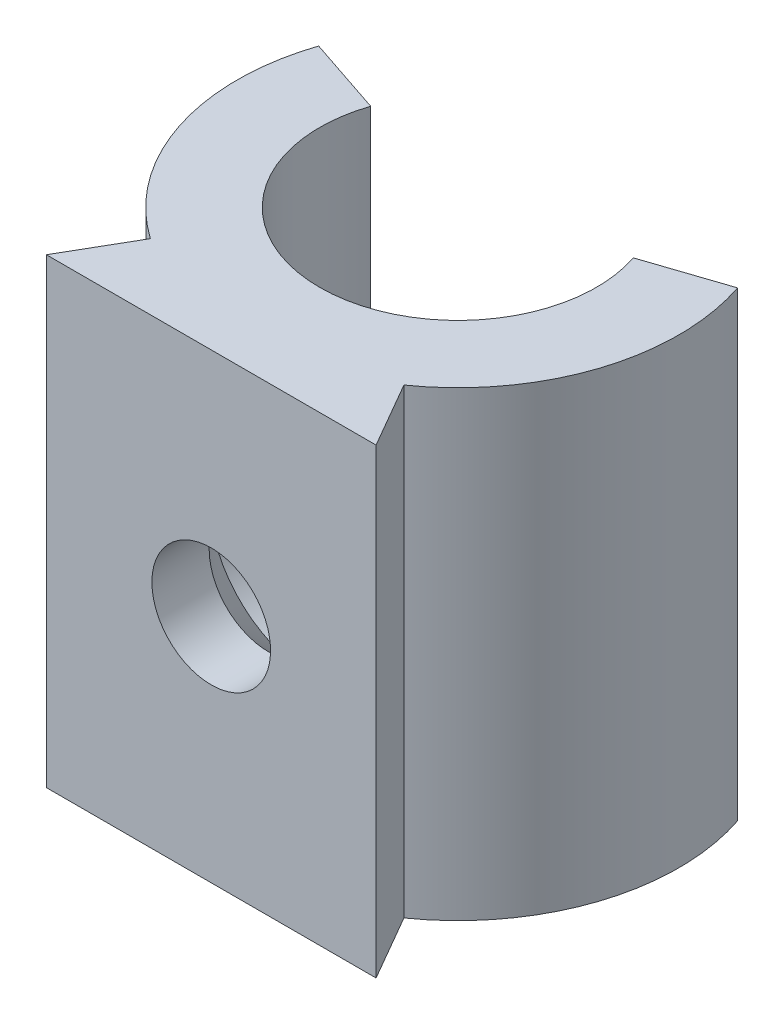
ISO-10303-21;
HEADER;
FILE_DESCRIPTION(('STEP AP214'),'2;1');
FILE_NAME('part.step','',(''),(''),'','','');
FILE_SCHEMA(('AUTOMOTIVE_DESIGN { 1 0 10303 214 1 1 1 1 }'));
ENDSEC;
DATA;
#1=APPLICATION_CONTEXT('core data for automotive mechanical design processes');
#2=APPLICATION_PROTOCOL_DEFINITION('international standard','automotive_design',2000,#1);
#3=PRODUCT_CONTEXT('',#1,'mechanical');
#4=PRODUCT('Part','Part','',(#3));
#5=PRODUCT_RELATED_PRODUCT_CATEGORY('part','',(#4));
#6=PRODUCT_DEFINITION_FORMATION('','',#4);
#7=PRODUCT_DEFINITION_CONTEXT('part definition',#1,'design');
#8=PRODUCT_DEFINITION('design','',#6,#7);
#9=PRODUCT_DEFINITION_SHAPE('','',#8);
#10=(LENGTH_UNIT() NAMED_UNIT(*) SI_UNIT(.MILLI.,.METRE.));
#11=(NAMED_UNIT(*) PLANE_ANGLE_UNIT() SI_UNIT($,.RADIAN.));
#12=(NAMED_UNIT(*) SI_UNIT($,.STERADIAN.) SOLID_ANGLE_UNIT());
#13=UNCERTAINTY_MEASURE_WITH_UNIT(LENGTH_MEASURE(1.E-05),#10,'distance_accuracy_value','');
#14=(GEOMETRIC_REPRESENTATION_CONTEXT(3) GLOBAL_UNCERTAINTY_ASSIGNED_CONTEXT((#13)) GLOBAL_UNIT_ASSIGNED_CONTEXT((#10,
#11,#12)) REPRESENTATION_CONTEXT('',''));
#15=CARTESIAN_POINT('',(0.,0.,0.));
#16=DIRECTION('',(0.,0.,1.));
#17=DIRECTION('',(1.,0.,0.));
#18=AXIS2_PLACEMENT_3D('',#15,#16,#17);
#19=CARTESIAN_POINT('',(0.,14.,0.));
#20=DIRECTION('',(0.,-1.,0.));
#21=DIRECTION('',(0.,0.,-1.));
#22=AXIS2_PLACEMENT_3D('',#19,#20,#21);
#23=CYLINDRICAL_SURFACE('',#22,6.7);
#24=CARTESIAN_POINT('',(0.,0.,0.));
#25=DIRECTION('',(0.,1.,0.));
#26=DIRECTION('',(0.,0.,1.));
#27=AXIS2_PLACEMENT_3D('',#24,#25,#26);
#28=CIRCLE('',#27,6.7);
#29=CARTESIAN_POINT('',(-6.35376848988154,0.,-2.1259411979141));
#30=VERTEX_POINT('',#29);
#31=CARTESIAN_POINT('',(-3.84529946162072,0.,5.48668133305183));
#32=VERTEX_POINT('',#31);
#33=EDGE_CURVE('E129',#30,#32,#28,.T.);
#34=ORIENTED_EDGE('',*,*,#33,.T.);
#35=DIRECTION('',(0.,-1.,0.));
#36=VECTOR('',#35,1.);
#37=CARTESIAN_POINT('',(-3.84529946162072,14.,5.48668133305183));
#38=LINE('',#37,#36);
#39=CARTESIAN_POINT('',(-3.84529946162072,14.,5.48668133305183));
#40=VERTEX_POINT('',#39);
#41=EDGE_CURVE('E11',#40,#32,#38,.T.);
#42=ORIENTED_EDGE('',*,*,#41,.F.);
#43=CARTESIAN_POINT('',(0.,14.,0.));
#44=DIRECTION('',(0.,1.,0.));
#45=DIRECTION('',(0.,0.,1.));
#46=AXIS2_PLACEMENT_3D('',#43,#44,#45);
#47=CIRCLE('',#46,6.7);
#48=CARTESIAN_POINT('',(-6.35376848988154,14.,-2.1259411979141));
#49=VERTEX_POINT('',#48);
#50=EDGE_CURVE('E88',#49,#40,#47,.T.);
#51=ORIENTED_EDGE('',*,*,#50,.F.);
#52=DIRECTION('',(0.,-1.,0.));
#53=VECTOR('',#52,1.);
#54=CARTESIAN_POINT('',(-6.35376848988154,14.,-2.1259411979141));
#55=LINE('',#54,#53);
#56=EDGE_CURVE('E125',#49,#30,#55,.T.);
#57=ORIENTED_EDGE('',*,*,#56,.T.);
#58=EDGE_LOOP('',(#34,#42,#51,#57));
#59=FACE_BOUND('',#58,.T.);
#60=ADVANCED_FACE('F34',(#59),#23,.T.);
#61=CARTESIAN_POINT('',(-0.508171887769092,14.,-0.293393176198093));
#62=DIRECTION('',(-0.866025403784433,0.,-0.50000000000001));
#63=DIRECTION('',(-0.50000000000001,0.,0.866025403784433));
#64=AXIS2_PLACEMENT_3D('',#61,#62,#63);
#65=PLANE('',#64);
#66=DIRECTION('',(0.50000000000001,0.,-0.866025403784433));
#67=VECTOR('',#66,1.);
#68=CARTESIAN_POINT('',(-0.508171887769092,0.,-0.293393176198093));
#69=LINE('',#68,#67);
#70=CARTESIAN_POINT('',(-5.,0.,7.48668133305183));
#71=VERTEX_POINT('',#70);
#72=EDGE_CURVE('E132',#71,#32,#69,.T.);
#73=ORIENTED_EDGE('',*,*,#72,.F.);
#74=DIRECTION('',(0.,-1.,0.));
#75=VECTOR('',#74,1.);
#76=CARTESIAN_POINT('',(-5.,14.,7.48668133305183));
#77=LINE('',#76,#75);
#78=CARTESIAN_POINT('',(-5.,14.,7.48668133305183));
#79=VERTEX_POINT('',#78);
#80=EDGE_CURVE('E43',#79,#71,#77,.T.);
#81=ORIENTED_EDGE('',*,*,#80,.F.);
#82=DIRECTION('',(0.50000000000001,0.,-0.866025403784433));
#83=VECTOR('',#82,1.);
#84=CARTESIAN_POINT('',(-0.508171887769092,14.,-0.293393176198093));
#85=LINE('',#84,#83);
#86=EDGE_CURVE('E199',#79,#40,#85,.T.);
#87=ORIENTED_EDGE('',*,*,#86,.T.);
#88=ORIENTED_EDGE('',*,*,#41,.T.);
#89=EDGE_LOOP('',(#73,#81,#87,#88));
#90=FACE_BOUND('',#89,.T.);
#91=ADVANCED_FACE('F186',(#90),#65,.T.);
#92=CARTESIAN_POINT('',(0.,14.,7.48668133305183));
#93=DIRECTION('',(0.,0.,-1.));
#94=DIRECTION('',(-1.,0.,0.));
#95=AXIS2_PLACEMENT_3D('',#92,#93,#94);
#96=PLANE('',#95);
#97=CARTESIAN_POINT('',(0.,7.,7.48668133305183));
#98=DIRECTION('',(0.,0.,-1.));
#99=DIRECTION('',(-1.,0.,0.));
#100=AXIS2_PLACEMENT_3D('',#97,#98,#99);
#101=CIRCLE('',#100,1.79999999999999);
#102=CARTESIAN_POINT('',(-1.79999999999999,7.,7.48668133305183));
#103=VERTEX_POINT('',#102);
#104=EDGE_CURVE('E37',#103,#103,#101,.T.);
#105=ORIENTED_EDGE('',*,*,#104,.T.);
#106=EDGE_LOOP('',(#105));
#107=FACE_BOUND('',#106,.T.);
#108=DIRECTION('',(1.,0.,0.));
#109=VECTOR('',#108,1.);
#110=CARTESIAN_POINT('',(0.,0.,7.48668133305183));
#111=LINE('',#110,#109);
#112=CARTESIAN_POINT('',(5.,0.,7.48668133305183));
#113=VERTEX_POINT('',#112);
#114=EDGE_CURVE('E136',#71,#113,#111,.T.);
#115=ORIENTED_EDGE('',*,*,#114,.T.);
#116=DIRECTION('',(0.,-1.,0.));
#117=VECTOR('',#116,1.);
#118=CARTESIAN_POINT('',(5.,14.,7.48668133305183));
#119=LINE('',#118,#117);
#120=CARTESIAN_POINT('',(5.,14.,7.48668133305183));
#121=VERTEX_POINT('',#120);
#122=EDGE_CURVE('E153',#121,#113,#119,.T.);
#123=ORIENTED_EDGE('',*,*,#122,.F.);
#124=DIRECTION('',(1.,0.,0.));
#125=VECTOR('',#124,1.);
#126=CARTESIAN_POINT('',(0.,14.,7.48668133305183));
#127=LINE('',#126,#125);
#128=EDGE_CURVE('E200',#79,#121,#127,.T.);
#129=ORIENTED_EDGE('',*,*,#128,.F.);
#130=ORIENTED_EDGE('',*,*,#80,.T.);
#131=EDGE_LOOP('',(#115,#123,#129,#130));
#132=FACE_BOUND('',#131,.T.);
#133=ADVANCED_FACE('F191',(#107,#132),#96,.F.);
#134=CARTESIAN_POINT('',(0.50817188776909,14.,-0.293393176198092));
#135=DIRECTION('',(-0.866025403784433,0.,0.50000000000001));
#136=DIRECTION('',(0.50000000000001,0.,0.866025403784433));
#137=AXIS2_PLACEMENT_3D('',#134,#135,#136);
#138=PLANE('',#137);
#139=DIRECTION('',(-0.50000000000001,0.,-0.866025403784433));
#140=VECTOR('',#139,1.);
#141=CARTESIAN_POINT('',(0.50817188776909,0.,-0.293393176198092));
#142=LINE('',#141,#140);
#143=CARTESIAN_POINT('',(3.84529946162072,0.,5.48668133305183));
#144=VERTEX_POINT('',#143);
#145=EDGE_CURVE('E138',#113,#144,#142,.T.);
#146=ORIENTED_EDGE('',*,*,#145,.T.);
#147=DIRECTION('',(0.,-1.,0.));
#148=VECTOR('',#147,1.);
#149=CARTESIAN_POINT('',(3.84529946162072,14.,5.48668133305183));
#150=LINE('',#149,#148);
#151=CARTESIAN_POINT('',(3.84529946162072,14.,5.48668133305183));
#152=VERTEX_POINT('',#151);
#153=EDGE_CURVE('E150',#152,#144,#150,.T.);
#154=ORIENTED_EDGE('',*,*,#153,.F.);
#155=DIRECTION('',(-0.50000000000001,0.,-0.866025403784433));
#156=VECTOR('',#155,1.);
#157=CARTESIAN_POINT('',(0.50817188776909,14.,-0.293393176198092));
#158=LINE('',#157,#156);
#159=EDGE_CURVE('E202',#121,#152,#158,.T.);
#160=ORIENTED_EDGE('',*,*,#159,.F.);
#161=ORIENTED_EDGE('',*,*,#122,.T.);
#162=EDGE_LOOP('',(#146,#154,#160,#161));
#163=FACE_BOUND('',#162,.T.);
#164=ADVANCED_FACE('F211',(#163),#138,.F.);
#165=CARTESIAN_POINT('',(0.,14.,0.));
#166=DIRECTION('',(0.,-1.,0.));
#167=DIRECTION('',(0.,0.,-1.));
#168=AXIS2_PLACEMENT_3D('',#165,#166,#167);
#169=CYLINDRICAL_SURFACE('',#168,6.7);
#170=CARTESIAN_POINT('',(0.,0.,0.));
#171=DIRECTION('',(0.,1.,0.));
#172=DIRECTION('',(0.,0.,1.));
#173=AXIS2_PLACEMENT_3D('',#170,#171,#172);
#174=CIRCLE('',#173,6.7);
#175=CARTESIAN_POINT('',(6.35376848988154,0.,-2.1259411979141));
#176=VERTEX_POINT('',#175);
#177=EDGE_CURVE('E140',#144,#176,#174,.T.);
#178=ORIENTED_EDGE('',*,*,#177,.T.);
#179=DIRECTION('',(0.,-1.,0.));
#180=VECTOR('',#179,1.);
#181=CARTESIAN_POINT('',(6.35376848988154,14.,-2.1259411979141));
#182=LINE('',#181,#180);
#183=CARTESIAN_POINT('',(6.35376848988154,14.,-2.1259411979141));
#184=VERTEX_POINT('',#183);
#185=EDGE_CURVE('E115',#184,#176,#182,.T.);
#186=ORIENTED_EDGE('',*,*,#185,.F.);
#187=CARTESIAN_POINT('',(0.,14.,0.));
#188=DIRECTION('',(0.,1.,0.));
#189=DIRECTION('',(0.,0.,1.));
#190=AXIS2_PLACEMENT_3D('',#187,#188,#189);
#191=CIRCLE('',#190,6.7);
#192=EDGE_CURVE('E120',#152,#184,#191,.T.);
#193=ORIENTED_EDGE('',*,*,#192,.F.);
#194=ORIENTED_EDGE('',*,*,#153,.T.);
#195=EDGE_LOOP('',(#178,#186,#193,#194));
#196=FACE_BOUND('',#195,.T.);
#197=ADVANCED_FACE('F214',(#196),#169,.T.);
#198=CARTESIAN_POINT('',(0.,14.,0.));
#199=DIRECTION('',(-0.31730465640509,0.,-0.9483236552062));
#200=DIRECTION('',(-0.9483236552062,0.,0.31730465640509));
#201=AXIS2_PLACEMENT_3D('',#198,#199,#200);
#202=PLANE('',#201);
#203=DIRECTION('',(0.9483236552062,0.,-0.31730465640509));
#204=VECTOR('',#203,1.);
#205=CARTESIAN_POINT('',(0.,0.,0.));
#206=LINE('',#205,#204);
#207=CARTESIAN_POINT('',(3.98295935186604,0.,-1.33267955690138));
#208=VERTEX_POINT('',#207);
#209=EDGE_CURVE('E110',#208,#176,#206,.T.);
#210=ORIENTED_EDGE('',*,*,#209,.F.);
#211=DIRECTION('',(0.,-1.,0.));
#212=VECTOR('',#211,1.);
#213=CARTESIAN_POINT('',(3.98295935186604,14.,-1.33267955690138));
#214=LINE('',#213,#212);
#215=CARTESIAN_POINT('',(3.98295935186604,14.,-1.33267955690138));
#216=VERTEX_POINT('',#215);
#217=EDGE_CURVE('E105',#216,#208,#214,.T.);
#218=ORIENTED_EDGE('',*,*,#217,.F.);
#219=DIRECTION('',(0.9483236552062,0.,-0.31730465640509));
#220=VECTOR('',#219,1.);
#221=CARTESIAN_POINT('',(0.,14.,0.));
#222=LINE('',#221,#220);
#223=EDGE_CURVE('E108',#216,#184,#222,.T.);
#224=ORIENTED_EDGE('',*,*,#223,.T.);
#225=ORIENTED_EDGE('',*,*,#185,.T.);
#226=EDGE_LOOP('',(#210,#218,#224,#225));
#227=FACE_BOUND('',#226,.T.);
#228=ADVANCED_FACE('F107',(#227),#202,.T.);
#229=CARTESIAN_POINT('',(0.,14.,0.));
#230=DIRECTION('',(0.,-1.,0.));
#231=DIRECTION('',(0.,0.,-1.));
#232=AXIS2_PLACEMENT_3D('',#229,#230,#231);
#233=CYLINDRICAL_SURFACE('',#232,4.2);
#234=CARTESIAN_POINT('',(-3.25,7.,2.6603571188846));
#235=CARTESIAN_POINT('',(-3.25000000998721,7.07475848898757,2.66035721413367));
#236=CARTESIAN_POINT('',(-3.24741298781828,7.14952034028254,2.66352689922681));
#237=CARTESIAN_POINT('',(-3.23715087854173,7.29817538690474,2.67598913535833));
#238=CARTESIAN_POINT('',(-3.22947503259781,7.37206845100722,2.68528259956243));
#239=CARTESIAN_POINT('',(-3.2092297462813,7.51848240576093,2.70944452495782));
#240=CARTESIAN_POINT('',(-3.19664512976643,7.59099830241468,2.72433027014456));
#241=CARTESIAN_POINT('',(-3.16688678849893,7.73394001249176,2.7588678420845));
#242=CARTESIAN_POINT('',(-3.14970956919945,7.80436418878032,2.77852329709013));
#243=CARTESIAN_POINT('',(-3.08340415028397,8.04194748846763,2.85263560670352));
#244=CARTESIAN_POINT('',(-3.02372782027654,8.20332924476597,2.91664498269966));
#245=CARTESIAN_POINT('',(-2.91800774540092,8.43349193390035,3.0212128892086));
#246=CARTESIAN_POINT('',(-2.88002030339123,8.50829720875071,3.05753543581508));
#247=CARTESIAN_POINT('',(-2.79883584657469,8.65407418562645,3.13201970435494));
#248=CARTESIAN_POINT('',(-2.7556400446346,8.72504677461413,3.17018099686302));
#249=CARTESIAN_POINT('',(-2.6160847333239,8.93585699377373,3.28803080914905));
#250=CARTESIAN_POINT('',(-2.51159888610736,9.06960157868124,3.3691758867704));
#251=CARTESIAN_POINT('',(-2.28225003283608,9.3200467673948,3.52857827766561));
#252=CARTESIAN_POINT('',(-2.15740220517659,9.43675994503446,3.60683768912216));
#253=CARTESIAN_POINT('',(-1.89370847587526,9.64640457549515,3.75173201607311));
#254=CARTESIAN_POINT('',(-1.75572026558275,9.74015650572712,3.81872691257474));
#255=CARTESIAN_POINT('',(-1.46276669981986,9.90708545857897,3.94022545157892));
#256=CARTESIAN_POINT('',(-1.30781762508281,9.98028197577237,3.99474092032711));
#257=CARTESIAN_POINT('',(-1.00841739872298,10.0930816633675,4.07964483508467));
#258=CARTESIAN_POINT('',(-0.865943176623363,10.1360976143986,4.11243954711693));
#259=CARTESIAN_POINT('',(-0.573929189960331,10.2024170083375,4.16323369626414));
#260=CARTESIAN_POINT('',(-0.424394046561995,10.2257331604375,4.18124267208454));
#261=CARTESIAN_POINT('',(-0.121996134048903,10.2512613525376,4.20096812894446));
#262=CARTESIAN_POINT('',(0.0308750461472652,10.2534118342477,4.20263708655911));
#263=CARTESIAN_POINT('',(0.3346880370679,10.236300303771,4.18940459797865));
#264=CARTESIAN_POINT('',(0.485629569195649,10.2170352342114,4.17450078578616));
#265=CARTESIAN_POINT('',(0.774601615336029,10.159629895086,4.13042889651161));
#266=CARTESIAN_POINT('',(0.912908065393063,10.122352936847,4.10191389757684));
#267=CARTESIAN_POINT('',(1.1807548115461,10.0312294155314,4.03298473536371));
#268=CARTESIAN_POINT('',(1.31029306503478,9.97737900765972,3.99256781110883));
#269=CARTESIAN_POINT('',(1.57170444789726,9.84879481986947,3.89757042505203));
#270=CARTESIAN_POINT('',(1.70240959790474,9.77246780692616,3.84195184181534));
#271=CARTESIAN_POINT('',(1.94957559146651,9.60461357830921,3.72263699199644));
#272=CARTESIAN_POINT('',(2.06602602756901,9.51307537045218,3.65893489188607));
#273=CARTESIAN_POINT('',(2.30620899383593,9.29675363785783,3.51352773555705));
#274=CARTESIAN_POINT('',(2.42663324402958,9.1689923179209,3.43079077343319));
#275=CARTESIAN_POINT('',(2.64553632681164,8.8958688002149,3.26496129780118));
#276=CARTESIAN_POINT('',(2.74399703619993,8.75049221873151,3.18186854790708));
#277=CARTESIAN_POINT('',(2.90347912036489,8.46771318422745,3.03636099830381));
#278=CARTESIAN_POINT('',(2.96798826607415,8.33288207588749,2.97278478816244));
#279=CARTESIAN_POINT('',(3.07899842169169,8.05122203263725,2.85764847234972));
#280=CARTESIAN_POINT('',(3.12553971170066,7.90442083829253,2.80606159379171));
#281=CARTESIAN_POINT('',(3.18919965053473,7.63684463913665,2.7332724875916));
#282=CARTESIAN_POINT('',(3.2107061666674,7.5183248059005,2.70774363803147));
#283=CARTESIAN_POINT('',(3.24040190815635,7.2774168524028,2.67214525587766));
#284=CARTESIAN_POINT('',(3.24861390515606,7.15503571347363,2.66204929057996));
#285=CARTESIAN_POINT('',(3.25106489127796,6.90958334045427,2.65905732081054));
#286=CARTESIAN_POINT('',(3.24526669191436,6.78651113673712,2.6662070931156));
#287=CARTESIAN_POINT('',(3.22013372192091,6.54371454020537,2.69649720598003));
#288=CARTESIAN_POINT('',(3.20077825982286,6.42399555601222,2.71966198838757));
#289=CARTESIAN_POINT('',(3.1415233856925,6.15236696848333,2.78809184667612));
#290=CARTESIAN_POINT('',(3.0969805593719,6.00270450152381,2.83810250089735));
#291=CARTESIAN_POINT('',(2.98930392669947,5.71537923165804,2.95129652001898));
#292=CARTESIAN_POINT('',(2.92611452398582,5.57775393261783,3.01451911053133));
#293=CARTESIAN_POINT('',(2.80636315212507,5.3577549306532,3.12548776753049));
#294=CARTESIAN_POINT('',(2.75435380611038,5.27199312978515,3.17156188707178));
#295=CARTESIAN_POINT('',(2.64300789121562,5.10606171392268,3.26493457593917));
#296=CARTESIAN_POINT('',(2.58366881359492,5.0258940283949,3.31223356009634));
#297=CARTESIAN_POINT('',(2.39499060646832,4.79405142425527,3.45378630647764));
#298=CARTESIAN_POINT('',(2.25483840956577,4.65075914091837,3.54784482822421));
#299=CARTESIAN_POINT('',(1.97288086511776,4.41187807114342,3.71075347020903));
#300=CARTESIAN_POINT('',(1.83532663213775,4.31231955840698,3.78118155805834));
#301=CARTESIAN_POINT('',(1.54218395451171,4.13408497920552,3.90987965646235));
#302=CARTESIAN_POINT('',(1.38662449717351,4.05537600013522,3.96816879780103));
#303=CARTESIAN_POINT('',(1.08665280761421,3.93349138932905,4.05951196600878));
#304=CARTESIAN_POINT('',(0.944528244466003,3.88662218757619,4.09512611668637));
#305=CARTESIAN_POINT('',(0.652398646617277,3.81259813407054,4.15168081465364));
#306=CARTESIAN_POINT('',(0.502397951302391,3.78543254625559,4.17262935269348));
#307=CARTESIAN_POINT('',(0.198122730899134,3.75242609173288,4.19810962132719));
#308=CARTESIAN_POINT('',(0.043835242802296,3.74665914308863,4.20258444578211));
#309=CARTESIAN_POINT('',(-0.263548684476795,3.7570553025526,4.19454161043351));
#310=CARTESIAN_POINT('',(-0.416645078513282,3.77321923786861,4.18202330966879));
#311=CARTESIAN_POINT('',(-0.708643546328776,3.82492230661565,4.14226585623928));
#312=CARTESIAN_POINT('',(-0.847863618884295,3.85935035968492,4.11587159170779));
#313=CARTESIAN_POINT('',(-1.11795958659373,3.94504320236258,4.05086209654031));
#314=CARTESIAN_POINT('',(-1.24883351347002,3.99631194611774,4.01224399585954));
#315=CARTESIAN_POINT('',(-1.51190520633302,4.11909032546042,3.92113333700956));
#316=CARTESIAN_POINT('',(-1.64309323314493,4.19203937183276,3.8676841927144));
#317=CARTESIAN_POINT('',(-1.89169079487814,4.35311856671447,3.75237498788266));
#318=CARTESIAN_POINT('',(-2.00909155071353,4.44125830075505,3.6905096218196));
#319=CARTESIAN_POINT('',(-2.25138000956492,4.64964571861689,3.54889766699839));
#320=CARTESIAN_POINT('',(-2.37312153637428,4.7727934467344,3.46804039788135));
#321=CARTESIAN_POINT('',(-2.59542424520123,5.03631727955483,3.30496135814837));
#322=CARTESIAN_POINT('',(-2.6959654945422,5.17670940309498,3.22273838112881));
#323=CARTESIAN_POINT('',(-2.86449348306107,5.45703207403462,3.07341008600135));
#324=CARTESIAN_POINT('',(-2.93489485764854,5.59515724416559,3.00565384747828));
#325=CARTESIAN_POINT('',(-3.05658594197445,5.8844939791704,2.88180382892642));
#326=CARTESIAN_POINT('',(-3.10790594905697,6.03568432461955,2.82569162368521));
#327=CARTESIAN_POINT('',(-3.18118437164521,6.32167840154663,2.74274007458116));
#328=CARTESIAN_POINT('',(-3.20678138436892,6.45447552068394,2.71243611486904));
#329=CARTESIAN_POINT('',(-3.23259913886483,6.65727275285679,2.68150436903624));
#330=CARTESIAN_POINT('',(-3.23910858188073,6.72541921746388,2.67361497678147));
#331=CARTESIAN_POINT('',(-3.24780806124303,6.86237637474153,2.66304244882851));
#332=CARTESIAN_POINT('',(-3.24999999080704,6.93118676297601,2.66035703121033));
#333=CARTESIAN_POINT('',(-3.25,7.,2.6603571188846));
#334=B_SPLINE_CURVE_WITH_KNOTS('',3,(#234,#235,#236,#237,#238,#239,#240,#241,#242,#243,#244,
#245,#246,#247,#248,#249,#250,#251,#252,#253,#254,#255,#256,#257,#258,#259,#260,#261,#262,#263,
#264,#265,#266,#267,#268,#269,#270,#271,#272,#273,#274,#275,#276,#277,#278,#279,#280,#281,#282,
#283,#284,#285,#286,#287,#288,#289,#290,#291,#292,#293,#294,#295,#296,#297,#298,#299,#300,#301,
#302,#303,#304,#305,#306,#307,#308,#309,#310,#311,#312,#313,#314,#315,#316,#317,#318,#319,#320,
#321,#322,#323,#324,#325,#326,#327,#328,#329,#330,#331,#332,#333),.UNSPECIFIED.,.T.,.F.,(4,2,2,
2,2,2,2,2,2,2,2,2,2,2,2,2,2,2,2,2,2,2,2,2,2,2,2,2,2,2,2,2,2,2,2,2,2,2,2,2,2,2,2,2,2,2,2,2,2,4),
(0.,0.22417251272119,0.448378461167311,0.673283138542594,0.898359437067409,1.44550530534593,
1.71963137827182,1.99369373851164,2.55604728930077,3.11798354589448,3.65519301709623,
4.1918912695512,4.64711893971883,5.10205269809231,5.55830919735396,6.01463084205,
6.45097406080636,6.88741858113044,7.36942537233874,7.85178200676705,8.43190904004692,
9.01251300843483,9.49835170750915,9.98309484621086,10.351002719065,10.7182797481149,
11.0865327430702,11.4553490040421,11.9445441468714,12.4352128637177,12.7659569426411,
13.0968145403589,13.7574920145212,14.3069356170628,14.8555066406034,15.315055365785,
15.7743535045678,16.2352367436799,16.6961373672624,17.1317636681654,17.5674923260977,
18.0437613043884,18.5203319226611,19.0915807239839,19.6633642466488,20.1693608266096,
20.6745505204105,21.088045232118,21.2944807180532,21.5008256624342),.UNSPECIFIED.);
#335=CARTESIAN_POINT('',(-3.25,7.,2.6603571188846));
#336=VERTEX_POINT('',#335);
#337=EDGE_CURVE('E133',#336,#336,#334,.T.);
#338=ORIENTED_EDGE('',*,*,#337,.F.);
#339=EDGE_LOOP('',(#338));
#340=FACE_BOUND('',#339,.T.);
#341=CARTESIAN_POINT('',(0.,0.,0.));
#342=DIRECTION('',(0.,1.,0.));
#343=DIRECTION('',(0.,0.,1.));
#344=AXIS2_PLACEMENT_3D('',#341,#342,#343);
#345=CIRCLE('',#344,4.2);
#346=CARTESIAN_POINT('',(-3.98295935186604,0.,-1.33267955690138));
#347=VERTEX_POINT('',#346);
#348=EDGE_CURVE('E144',#347,#208,#345,.T.);
#349=ORIENTED_EDGE('',*,*,#348,.F.);
#350=DIRECTION('',(0.,-1.,0.));
#351=VECTOR('',#350,1.);
#352=CARTESIAN_POINT('',(-3.98295935186604,14.,-1.33267955690138));
#353=LINE('',#352,#351);
#354=CARTESIAN_POINT('',(-3.98295935186604,14.,-1.33267955690138));
#355=VERTEX_POINT('',#354);
#356=EDGE_CURVE('E79',#355,#347,#353,.T.);
#357=ORIENTED_EDGE('',*,*,#356,.F.);
#358=CARTESIAN_POINT('',(0.,14.,0.));
#359=DIRECTION('',(0.,1.,0.));
#360=DIRECTION('',(0.,0.,1.));
#361=AXIS2_PLACEMENT_3D('',#358,#359,#360);
#362=CIRCLE('',#361,4.2);
#363=EDGE_CURVE('E118',#355,#216,#362,.T.);
#364=ORIENTED_EDGE('',*,*,#363,.T.);
#365=ORIENTED_EDGE('',*,*,#217,.T.);
#366=EDGE_LOOP('',(#349,#357,#364,#365));
#367=FACE_BOUND('',#366,.T.);
#368=ADVANCED_FACE('F123',(#340,#367),#233,.F.);
#369=CARTESIAN_POINT('',(0.,14.,0.));
#370=DIRECTION('',(-0.31730465640509,0.,0.9483236552062));
#371=DIRECTION('',(0.9483236552062,0.,0.31730465640509));
#372=AXIS2_PLACEMENT_3D('',#369,#370,#371);
#373=PLANE('',#372);
#374=DIRECTION('',(-0.9483236552062,0.,-0.31730465640509));
#375=VECTOR('',#374,1.);
#376=CARTESIAN_POINT('',(0.,0.,0.));
#377=LINE('',#376,#375);
#378=EDGE_CURVE('E82',#347,#30,#377,.T.);
#379=ORIENTED_EDGE('',*,*,#378,.T.);
#380=ORIENTED_EDGE('',*,*,#56,.F.);
#381=DIRECTION('',(-0.9483236552062,0.,-0.31730465640509));
#382=VECTOR('',#381,1.);
#383=CARTESIAN_POINT('',(0.,14.,0.));
#384=LINE('',#383,#382);
#385=EDGE_CURVE('E52',#355,#49,#384,.T.);
#386=ORIENTED_EDGE('',*,*,#385,.F.);
#387=ORIENTED_EDGE('',*,*,#356,.T.);
#388=EDGE_LOOP('',(#379,#380,#386,#387));
#389=FACE_BOUND('',#388,.T.);
#390=ADVANCED_FACE('F177',(#389),#373,.F.);
#391=CARTESIAN_POINT('',(0.,14.,0.));
#392=DIRECTION('',(0.,1.,0.));
#393=DIRECTION('',(0.,0.,1.));
#394=AXIS2_PLACEMENT_3D('',#391,#392,#393);
#395=PLANE('',#394);
#396=ORIENTED_EDGE('',*,*,#50,.T.);
#397=ORIENTED_EDGE('',*,*,#86,.F.);
#398=ORIENTED_EDGE('',*,*,#128,.T.);
#399=ORIENTED_EDGE('',*,*,#159,.T.);
#400=ORIENTED_EDGE('',*,*,#192,.T.);
#401=ORIENTED_EDGE('',*,*,#223,.F.);
#402=ORIENTED_EDGE('',*,*,#363,.F.);
#403=ORIENTED_EDGE('',*,*,#385,.T.);
#404=EDGE_LOOP('',(#396,#397,#398,#399,#400,#401,#402,#403));
#405=FACE_BOUND('',#404,.T.);
#406=ADVANCED_FACE('F117',(#405),#395,.T.);
#407=CARTESIAN_POINT('',(0.,0.,0.));
#408=DIRECTION('',(0.,1.,0.));
#409=DIRECTION('',(0.,0.,1.));
#410=AXIS2_PLACEMENT_3D('',#407,#408,#409);
#411=PLANE('',#410);
#412=ORIENTED_EDGE('',*,*,#33,.F.);
#413=ORIENTED_EDGE('',*,*,#378,.F.);
#414=ORIENTED_EDGE('',*,*,#348,.T.);
#415=ORIENTED_EDGE('',*,*,#209,.T.);
#416=ORIENTED_EDGE('',*,*,#177,.F.);
#417=ORIENTED_EDGE('',*,*,#145,.F.);
#418=ORIENTED_EDGE('',*,*,#114,.F.);
#419=ORIENTED_EDGE('',*,*,#72,.T.);
#420=EDGE_LOOP('',(#412,#413,#414,#415,#416,#417,#418,#419));
#421=FACE_BOUND('',#420,.T.);
#422=ADVANCED_FACE('F172',(#421),#411,.F.);
#423=CARTESIAN_POINT('',(0.,7.,4.4));
#424=DIRECTION('',(0.,0.,-1.));
#425=DIRECTION('',(-1.,0.,0.));
#426=AXIS2_PLACEMENT_3D('',#423,#424,#425);
#427=CYLINDRICAL_SURFACE('',#426,3.25);
#428=ORIENTED_EDGE('',*,*,#337,.T.);
#429=EDGE_LOOP('',(#428));
#430=FACE_BOUND('',#429,.T.);
#431=CARTESIAN_POINT('',(0.,7.,4.4));
#432=DIRECTION('',(0.,0.,-1.));
#433=DIRECTION('',(-1.,0.,0.));
#434=AXIS2_PLACEMENT_3D('',#431,#432,#433);
#435=CIRCLE('',#434,3.25);
#436=CARTESIAN_POINT('',(-3.25,7.,4.4));
#437=VERTEX_POINT('',#436);
#438=EDGE_CURVE('E162',#437,#437,#435,.T.);
#439=ORIENTED_EDGE('',*,*,#438,.F.);
#440=EDGE_LOOP('',(#439));
#441=FACE_BOUND('',#440,.T.);
#442=ADVANCED_FACE('F166',(#430,#441),#427,.F.);
#443=CARTESIAN_POINT('',(0.,7.,4.4));
#444=DIRECTION('',(0.,0.,-1.));
#445=DIRECTION('',(-1.,0.,0.));
#446=AXIS2_PLACEMENT_3D('',#443,#444,#445);
#447=PLANE('',#446);
#448=CARTESIAN_POINT('',(0.,7.,4.4));
#449=DIRECTION('',(0.,0.,-1.));
#450=DIRECTION('',(-1.,0.,0.));
#451=AXIS2_PLACEMENT_3D('',#448,#449,#450);
#452=CIRCLE('',#451,3.15);
#453=CARTESIAN_POINT('',(-3.15,7.,4.4));
#454=VERTEX_POINT('',#453);
#455=EDGE_CURVE('E234',#454,#454,#452,.T.);
#456=ORIENTED_EDGE('',*,*,#455,.F.);
#457=EDGE_LOOP('',(#456));
#458=FACE_BOUND('',#457,.T.);
#459=ORIENTED_EDGE('',*,*,#438,.T.);
#460=EDGE_LOOP('',(#459));
#461=FACE_BOUND('',#460,.T.);
#462=ADVANCED_FACE('F171',(#458,#461),#447,.T.);
#463=CARTESIAN_POINT('',(0.,7.,4.4));
#464=DIRECTION('',(0.,0.,-1.));
#465=DIRECTION('',(-1.,0.,0.));
#466=AXIS2_PLACEMENT_3D('',#463,#464,#465);
#467=CYLINDRICAL_SURFACE('',#466,1.79999999999999);
#468=CARTESIAN_POINT('',(0.,7.,5.75));
#469=DIRECTION('',(0.,0.,-1.));
#470=DIRECTION('',(-1.,0.,0.));
#471=AXIS2_PLACEMENT_3D('',#468,#469,#470);
#472=CIRCLE('',#471,1.8);
#473=CARTESIAN_POINT('',(-1.8,7.,5.75));
#474=VERTEX_POINT('',#473);
#475=EDGE_CURVE('E231',#474,#474,#472,.T.);
#476=ORIENTED_EDGE('',*,*,#475,.T.);
#477=EDGE_LOOP('',(#476));
#478=FACE_BOUND('',#477,.T.);
#479=ORIENTED_EDGE('',*,*,#104,.F.);
#480=EDGE_LOOP('',(#479));
#481=FACE_BOUND('',#480,.T.);
#482=ADVANCED_FACE('F246',(#478,#481),#467,.F.);
#483=CARTESIAN_POINT('',(0.,7.,4.4));
#484=DIRECTION('',(0.,0.,-1.));
#485=DIRECTION('',(-1.,0.,0.));
#486=AXIS2_PLACEMENT_3D('',#483,#484,#485);
#487=CONICAL_SURFACE('',#486,3.15,0.785398163397448);
#488=ORIENTED_EDGE('',*,*,#475,.F.);
#489=EDGE_LOOP('',(#488));
#490=FACE_BOUND('',#489,.T.);
#491=ORIENTED_EDGE('',*,*,#455,.T.);
#492=EDGE_LOOP('',(#491));
#493=FACE_BOUND('',#492,.T.);
#494=ADVANCED_FACE('F242',(#490,#493),#487,.F.);
#495=CLOSED_SHELL('',(#60,#91,#133,#164,#197,#228,#368,#390,#406,#422,#442,#462,#482,#494));
#496=MANIFOLD_SOLID_BREP('B2',#495);
#497=ADVANCED_BREP_SHAPE_REPRESENTATION('',(#18,#496),#14);
#498=SHAPE_DEFINITION_REPRESENTATION(#9,#497);
ENDSEC;
END-ISO-10303-21;
